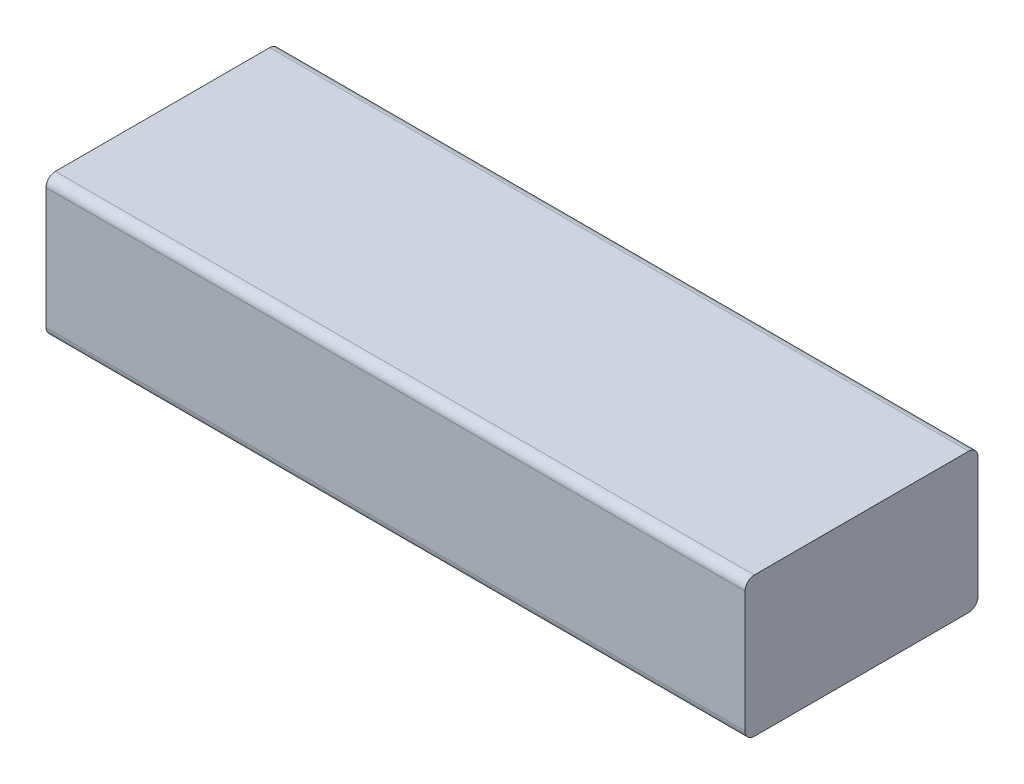
ISO-10303-21;
HEADER;
FILE_DESCRIPTION(('STEP AP214'),'2;1');
FILE_NAME('part.step','',(''),(''),'','','');
FILE_SCHEMA(('AUTOMOTIVE_DESIGN { 1 0 10303 214 1 1 1 1 }'));
ENDSEC;
DATA;
#1=APPLICATION_CONTEXT('core data for automotive mechanical design processes');
#2=APPLICATION_PROTOCOL_DEFINITION('international standard','automotive_design',2000,#1);
#3=PRODUCT_CONTEXT('',#1,'mechanical');
#4=PRODUCT('Part','Part','',(#3));
#5=PRODUCT_RELATED_PRODUCT_CATEGORY('part','',(#4));
#6=PRODUCT_DEFINITION_FORMATION('','',#4);
#7=PRODUCT_DEFINITION_CONTEXT('part definition',#1,'design');
#8=PRODUCT_DEFINITION('design','',#6,#7);
#9=PRODUCT_DEFINITION_SHAPE('','',#8);
#10=(LENGTH_UNIT() NAMED_UNIT(*) SI_UNIT(.MILLI.,.METRE.));
#11=(NAMED_UNIT(*) PLANE_ANGLE_UNIT() SI_UNIT($,.RADIAN.));
#12=(NAMED_UNIT(*) SI_UNIT($,.STERADIAN.) SOLID_ANGLE_UNIT());
#13=UNCERTAINTY_MEASURE_WITH_UNIT(LENGTH_MEASURE(1.E-05),#10,'distance_accuracy_value','');
#14=(GEOMETRIC_REPRESENTATION_CONTEXT(3) GLOBAL_UNCERTAINTY_ASSIGNED_CONTEXT((#13)) GLOBAL_UNIT_ASSIGNED_CONTEXT((#10,
#11,#12)) REPRESENTATION_CONTEXT('',''));
#15=CARTESIAN_POINT('',(0.,0.,0.));
#16=DIRECTION('',(0.,0.,1.));
#17=DIRECTION('',(1.,0.,0.));
#18=AXIS2_PLACEMENT_3D('',#15,#16,#17);
#19=CARTESIAN_POINT('',(-23.9285714285714,15.,-17.0535714285714));
#20=DIRECTION('',(1.,0.,0.));
#21=DIRECTION('',(0.,0.,-1.));
#22=AXIS2_PLACEMENT_3D('',#19,#20,#21);
#23=PLANE('',#22);
#24=DIRECTION('',(0.,0.,1.));
#25=VECTOR('',#24,1.);
#26=CARTESIAN_POINT('',(-23.9285714285714,15.,-17.0535714285714));
#27=LINE('',#26,#25);
#28=CARTESIAN_POINT('',(-23.9285714285714,15.,-16.0535714285714));
#29=VERTEX_POINT('',#28);
#30=CARTESIAN_POINT('',(-23.9285714285714,15.,6.94642857142856));
#31=VERTEX_POINT('',#30);
#32=EDGE_CURVE('E125',#29,#31,#27,.T.);
#33=ORIENTED_EDGE('',*,*,#32,.F.);
#34=CARTESIAN_POINT('',(-23.9285714285714,14.,-16.0535714285714));
#35=DIRECTION('',(1.,0.,0.));
#36=DIRECTION('',(0.,0.,-1.));
#37=AXIS2_PLACEMENT_3D('',#34,#35,#36);
#38=CIRCLE('',#37,1.);
#39=CARTESIAN_POINT('',(-23.9285714285714,14.,-17.0535714285714));
#40=VERTEX_POINT('',#39);
#41=EDGE_CURVE('E106',#29,#40,#38,.F.);
#42=ORIENTED_EDGE('',*,*,#41,.T.);
#43=DIRECTION('',(0.,-1.,0.));
#44=VECTOR('',#43,1.);
#45=CARTESIAN_POINT('',(-23.9285714285714,15.,-17.0535714285714));
#46=LINE('',#45,#44);
#47=CARTESIAN_POINT('',(-23.9285714285714,1.,-17.0535714285714));
#48=VERTEX_POINT('',#47);
#49=EDGE_CURVE('E139',#40,#48,#46,.T.);
#50=ORIENTED_EDGE('',*,*,#49,.T.);
#51=CARTESIAN_POINT('',(-23.9285714285714,1.,-16.0535714285714));
#52=DIRECTION('',(1.,0.,0.));
#53=DIRECTION('',(0.,0.,-1.));
#54=AXIS2_PLACEMENT_3D('',#51,#52,#53);
#55=CIRCLE('',#54,1.);
#56=CARTESIAN_POINT('',(-23.9285714285714,0.,-16.0535714285714));
#57=VERTEX_POINT('',#56);
#58=EDGE_CURVE('E118',#48,#57,#55,.F.);
#59=ORIENTED_EDGE('',*,*,#58,.T.);
#60=DIRECTION('',(0.,0.,1.));
#61=VECTOR('',#60,1.);
#62=CARTESIAN_POINT('',(-23.9285714285714,0.,-17.0535714285714));
#63=LINE('',#62,#61);
#64=CARTESIAN_POINT('',(-23.9285714285714,0.,6.94642857142856));
#65=VERTEX_POINT('',#64);
#66=EDGE_CURVE('E142',#57,#65,#63,.T.);
#67=ORIENTED_EDGE('',*,*,#66,.T.);
#68=CARTESIAN_POINT('',(-23.9285714285714,1.,6.94642857142856));
#69=DIRECTION('',(1.,0.,0.));
#70=DIRECTION('',(0.,0.,-1.));
#71=AXIS2_PLACEMENT_3D('',#68,#69,#70);
#72=CIRCLE('',#71,1.);
#73=CARTESIAN_POINT('',(-23.9285714285714,1.,7.94642857142856));
#74=VERTEX_POINT('',#73);
#75=EDGE_CURVE('E165',#65,#74,#72,.F.);
#76=ORIENTED_EDGE('',*,*,#75,.T.);
#77=DIRECTION('',(0.,-1.,0.));
#78=VECTOR('',#77,1.);
#79=CARTESIAN_POINT('',(-23.9285714285714,15.,7.94642857142856));
#80=LINE('',#79,#78);
#81=CARTESIAN_POINT('',(-23.9285714285714,14.,7.94642857142856));
#82=VERTEX_POINT('',#81);
#83=EDGE_CURVE('E157',#82,#74,#80,.T.);
#84=ORIENTED_EDGE('',*,*,#83,.F.);
#85=CARTESIAN_POINT('',(-23.9285714285714,14.,6.94642857142856));
#86=DIRECTION('',(1.,0.,0.));
#87=DIRECTION('',(0.,0.,-1.));
#88=AXIS2_PLACEMENT_3D('',#85,#86,#87);
#89=CIRCLE('',#88,1.);
#90=EDGE_CURVE('E129',#82,#31,#89,.F.);
#91=ORIENTED_EDGE('',*,*,#90,.T.);
#92=EDGE_LOOP('',(#33,#42,#50,#59,#67,#76,#84,#91));
#93=FACE_BOUND('',#92,.T.);
#94=ADVANCED_FACE('F39',(#93),#23,.F.);
#95=CARTESIAN_POINT('',(-23.9285714285714,15.,7.94642857142856));
#96=DIRECTION('',(0.,0.,-1.));
#97=DIRECTION('',(-1.,0.,0.));
#98=AXIS2_PLACEMENT_3D('',#95,#96,#97);
#99=PLANE('',#98);
#100=ORIENTED_EDGE('',*,*,#83,.T.);
#101=DIRECTION('',(1.,0.,0.));
#102=VECTOR('',#101,1.);
#103=CARTESIAN_POINT('',(-23.9285714285714,1.,7.94642857142856));
#104=LINE('',#103,#102);
#105=CARTESIAN_POINT('',(51.0714285714286,1.,7.94642857142857));
#106=VERTEX_POINT('',#105);
#107=EDGE_CURVE('E11',#74,#106,#104,.T.);
#108=ORIENTED_EDGE('',*,*,#107,.T.);
#109=DIRECTION('',(0.,-1.,0.));
#110=VECTOR('',#109,1.);
#111=CARTESIAN_POINT('',(51.0714285714286,15.,7.94642857142857));
#112=LINE('',#111,#110);
#113=CARTESIAN_POINT('',(51.0714285714286,14.,7.94642857142857));
#114=VERTEX_POINT('',#113);
#115=EDGE_CURVE('E154',#114,#106,#112,.T.);
#116=ORIENTED_EDGE('',*,*,#115,.F.);
#117=DIRECTION('',(1.,0.,0.));
#118=VECTOR('',#117,1.);
#119=CARTESIAN_POINT('',(-23.9285714285714,14.,7.94642857142856));
#120=LINE('',#119,#118);
#121=EDGE_CURVE('E48',#114,#82,#120,.F.);
#122=ORIENTED_EDGE('',*,*,#121,.T.);
#123=EDGE_LOOP('',(#100,#108,#116,#122));
#124=FACE_BOUND('',#123,.T.);
#125=ADVANCED_FACE('F193',(#124),#99,.F.);
#126=CARTESIAN_POINT('',(51.0714285714286,15.,-17.0535714285714));
#127=DIRECTION('',(-1.,0.,0.));
#128=DIRECTION('',(0.,0.,1.));
#129=AXIS2_PLACEMENT_3D('',#126,#127,#128);
#130=PLANE('',#129);
#131=DIRECTION('',(0.,-1.,0.));
#132=VECTOR('',#131,1.);
#133=CARTESIAN_POINT('',(51.0714285714286,15.,-17.0535714285714));
#134=LINE('',#133,#132);
#135=CARTESIAN_POINT('',(51.0714285714286,14.,-17.0535714285714));
#136=VERTEX_POINT('',#135);
#137=CARTESIAN_POINT('',(51.0714285714286,1.,-17.0535714285714));
#138=VERTEX_POINT('',#137);
#139=EDGE_CURVE('E150',#136,#138,#134,.T.);
#140=ORIENTED_EDGE('',*,*,#139,.F.);
#141=CARTESIAN_POINT('',(51.0714285714286,14.,-16.0535714285714));
#142=DIRECTION('',(-1.,0.,0.));
#143=DIRECTION('',(0.,0.,1.));
#144=AXIS2_PLACEMENT_3D('',#141,#142,#143);
#145=CIRCLE('',#144,1.);
#146=CARTESIAN_POINT('',(51.0714285714286,15.,-16.0535714285714));
#147=VERTEX_POINT('',#146);
#148=EDGE_CURVE('E182',#136,#147,#145,.F.);
#149=ORIENTED_EDGE('',*,*,#148,.T.);
#150=DIRECTION('',(0.,0.,-1.));
#151=VECTOR('',#150,1.);
#152=CARTESIAN_POINT('',(51.0714285714286,15.,-17.0535714285714));
#153=LINE('',#152,#151);
#154=CARTESIAN_POINT('',(51.0714285714286,15.,6.94642857142856));
#155=VERTEX_POINT('',#154);
#156=EDGE_CURVE('E127',#155,#147,#153,.T.);
#157=ORIENTED_EDGE('',*,*,#156,.F.);
#158=CARTESIAN_POINT('',(51.0714285714286,14.,6.94642857142857));
#159=DIRECTION('',(-1.,0.,0.));
#160=DIRECTION('',(0.,0.,1.));
#161=AXIS2_PLACEMENT_3D('',#158,#159,#160);
#162=CIRCLE('',#161,1.);
#163=EDGE_CURVE('E62',#155,#114,#162,.F.);
#164=ORIENTED_EDGE('',*,*,#163,.T.);
#165=ORIENTED_EDGE('',*,*,#115,.T.);
#166=CARTESIAN_POINT('',(51.0714285714286,1.,6.94642857142857));
#167=DIRECTION('',(-1.,0.,0.));
#168=DIRECTION('',(0.,0.,1.));
#169=AXIS2_PLACEMENT_3D('',#166,#167,#168);
#170=CIRCLE('',#169,1.);
#171=CARTESIAN_POINT('',(51.0714285714286,0.,6.94642857142856));
#172=VERTEX_POINT('',#171);
#173=EDGE_CURVE('E55',#106,#172,#170,.F.);
#174=ORIENTED_EDGE('',*,*,#173,.T.);
#175=DIRECTION('',(0.,0.,-1.));
#176=VECTOR('',#175,1.);
#177=CARTESIAN_POINT('',(51.0714285714286,0.,-17.0535714285714));
#178=LINE('',#177,#176);
#179=CARTESIAN_POINT('',(51.0714285714286,0.,-16.0535714285714));
#180=VERTEX_POINT('',#179);
#181=EDGE_CURVE('E135',#172,#180,#178,.T.);
#182=ORIENTED_EDGE('',*,*,#181,.T.);
#183=CARTESIAN_POINT('',(51.0714285714286,1.,-16.0535714285714));
#184=DIRECTION('',(-1.,0.,0.));
#185=DIRECTION('',(0.,0.,1.));
#186=AXIS2_PLACEMENT_3D('',#183,#184,#185);
#187=CIRCLE('',#186,1.);
#188=EDGE_CURVE('E179',#180,#138,#187,.F.);
#189=ORIENTED_EDGE('',*,*,#188,.T.);
#190=EDGE_LOOP('',(#140,#149,#157,#164,#165,#174,#182,#189));
#191=FACE_BOUND('',#190,.T.);
#192=ADVANCED_FACE('F197',(#191),#130,.F.);
#193=CARTESIAN_POINT('',(-23.9285714285714,15.,-17.0535714285714));
#194=DIRECTION('',(0.,0.,1.));
#195=DIRECTION('',(1.,0.,0.));
#196=AXIS2_PLACEMENT_3D('',#193,#194,#195);
#197=PLANE('',#196);
#198=ORIENTED_EDGE('',*,*,#49,.F.);
#199=DIRECTION('',(-1.,0.,0.));
#200=VECTOR('',#199,1.);
#201=CARTESIAN_POINT('',(51.0714285714286,14.,-17.0535714285714));
#202=LINE('',#201,#200);
#203=EDGE_CURVE('E111',#40,#136,#202,.F.);
#204=ORIENTED_EDGE('',*,*,#203,.T.);
#205=ORIENTED_EDGE('',*,*,#139,.T.);
#206=DIRECTION('',(-1.,0.,0.));
#207=VECTOR('',#206,1.);
#208=CARTESIAN_POINT('',(-23.9285714285714,1.,-17.0535714285714));
#209=LINE('',#208,#207);
#210=EDGE_CURVE('E117',#138,#48,#209,.T.);
#211=ORIENTED_EDGE('',*,*,#210,.T.);
#212=EDGE_LOOP('',(#198,#204,#205,#211));
#213=FACE_BOUND('',#212,.T.);
#214=ADVANCED_FACE('F201',(#213),#197,.F.);
#215=CARTESIAN_POINT('',(0.,15.,0.));
#216=DIRECTION('',(0.,1.,0.));
#217=DIRECTION('',(0.,0.,1.));
#218=AXIS2_PLACEMENT_3D('',#215,#216,#217);
#219=PLANE('',#218);
#220=ORIENTED_EDGE('',*,*,#156,.T.);
#221=DIRECTION('',(-1.,0.,0.));
#222=VECTOR('',#221,1.);
#223=CARTESIAN_POINT('',(-23.9285714285714,15.,-16.0535714285714));
#224=LINE('',#223,#222);
#225=EDGE_CURVE('E110',#147,#29,#224,.T.);
#226=ORIENTED_EDGE('',*,*,#225,.T.);
#227=ORIENTED_EDGE('',*,*,#32,.T.);
#228=DIRECTION('',(1.,0.,0.));
#229=VECTOR('',#228,1.);
#230=CARTESIAN_POINT('',(51.0714285714286,15.,6.94642857142857));
#231=LINE('',#230,#229);
#232=EDGE_CURVE('E130',#31,#155,#231,.T.);
#233=ORIENTED_EDGE('',*,*,#232,.T.);
#234=EDGE_LOOP('',(#220,#226,#227,#233));
#235=FACE_BOUND('',#234,.T.);
#236=ADVANCED_FACE('F123',(#235),#219,.T.);
#237=CARTESIAN_POINT('',(0.,0.,0.));
#238=DIRECTION('',(0.,1.,0.));
#239=DIRECTION('',(0.,0.,1.));
#240=AXIS2_PLACEMENT_3D('',#237,#238,#239);
#241=PLANE('',#240);
#242=ORIENTED_EDGE('',*,*,#66,.F.);
#243=DIRECTION('',(-1.,0.,0.));
#244=VECTOR('',#243,1.);
#245=CARTESIAN_POINT('',(0.,0.,-16.0535714285714));
#246=LINE('',#245,#244);
#247=EDGE_CURVE('E188',#57,#180,#246,.F.);
#248=ORIENTED_EDGE('',*,*,#247,.T.);
#249=ORIENTED_EDGE('',*,*,#181,.F.);
#250=DIRECTION('',(1.,0.,0.));
#251=VECTOR('',#250,1.);
#252=CARTESIAN_POINT('',(0.,0.,6.94642857142856));
#253=LINE('',#252,#251);
#254=EDGE_CURVE('E185',#172,#65,#253,.F.);
#255=ORIENTED_EDGE('',*,*,#254,.T.);
#256=EDGE_LOOP('',(#242,#248,#249,#255));
#257=FACE_BOUND('',#256,.T.);
#258=ADVANCED_FACE('F207',(#257),#241,.F.);
#259=CARTESIAN_POINT('',(0.,14.,-16.0535714285714));
#260=DIRECTION('',(1.,0.,0.));
#261=DIRECTION('',(0.,0.,-1.));
#262=AXIS2_PLACEMENT_3D('',#259,#260,#261);
#263=CYLINDRICAL_SURFACE('',#262,1.);
#264=ORIENTED_EDGE('',*,*,#148,.F.);
#265=ORIENTED_EDGE('',*,*,#203,.F.);
#266=ORIENTED_EDGE('',*,*,#41,.F.);
#267=ORIENTED_EDGE('',*,*,#225,.F.);
#268=EDGE_LOOP('',(#264,#265,#266,#267));
#269=FACE_BOUND('',#268,.T.);
#270=ADVANCED_FACE('F109',(#269),#263,.T.);
#271=CARTESIAN_POINT('',(-23.9285714285714,1.,-16.0535714285714));
#272=DIRECTION('',(-1.,0.,0.));
#273=DIRECTION('',(0.,0.,1.));
#274=AXIS2_PLACEMENT_3D('',#271,#272,#273);
#275=CYLINDRICAL_SURFACE('',#274,1.);
#276=ORIENTED_EDGE('',*,*,#188,.F.);
#277=ORIENTED_EDGE('',*,*,#247,.F.);
#278=ORIENTED_EDGE('',*,*,#58,.F.);
#279=ORIENTED_EDGE('',*,*,#210,.F.);
#280=EDGE_LOOP('',(#276,#277,#278,#279));
#281=FACE_BOUND('',#280,.T.);
#282=ADVANCED_FACE('F203',(#281),#275,.T.);
#283=CARTESIAN_POINT('',(-23.9285714285714,1.,6.94642857142856));
#284=DIRECTION('',(1.,0.,0.));
#285=DIRECTION('',(0.,0.,-1.));
#286=AXIS2_PLACEMENT_3D('',#283,#284,#285);
#287=CYLINDRICAL_SURFACE('',#286,1.);
#288=ORIENTED_EDGE('',*,*,#75,.F.);
#289=ORIENTED_EDGE('',*,*,#254,.F.);
#290=ORIENTED_EDGE('',*,*,#173,.F.);
#291=ORIENTED_EDGE('',*,*,#107,.F.);
#292=EDGE_LOOP('',(#288,#289,#290,#291));
#293=FACE_BOUND('',#292,.T.);
#294=ADVANCED_FACE('F209',(#293),#287,.T.);
#295=CARTESIAN_POINT('',(0.,14.,6.94642857142856));
#296=DIRECTION('',(-1.,0.,0.));
#297=DIRECTION('',(0.,0.,1.));
#298=AXIS2_PLACEMENT_3D('',#295,#296,#297);
#299=CYLINDRICAL_SURFACE('',#298,1.);
#300=ORIENTED_EDGE('',*,*,#90,.F.);
#301=ORIENTED_EDGE('',*,*,#121,.F.);
#302=ORIENTED_EDGE('',*,*,#163,.F.);
#303=ORIENTED_EDGE('',*,*,#232,.F.);
#304=EDGE_LOOP('',(#300,#301,#302,#303));
#305=FACE_BOUND('',#304,.T.);
#306=ADVANCED_FACE('F41',(#305),#299,.T.);
#307=CLOSED_SHELL('',(#94,#125,#192,#214,#236,#258,#270,#282,#294,#306));
#308=MANIFOLD_SOLID_BREP('B2',#307);
#309=ADVANCED_BREP_SHAPE_REPRESENTATION('',(#18,#308),#14);
#310=SHAPE_DEFINITION_REPRESENTATION(#9,#309);
ENDSEC;
END-ISO-10303-21;
